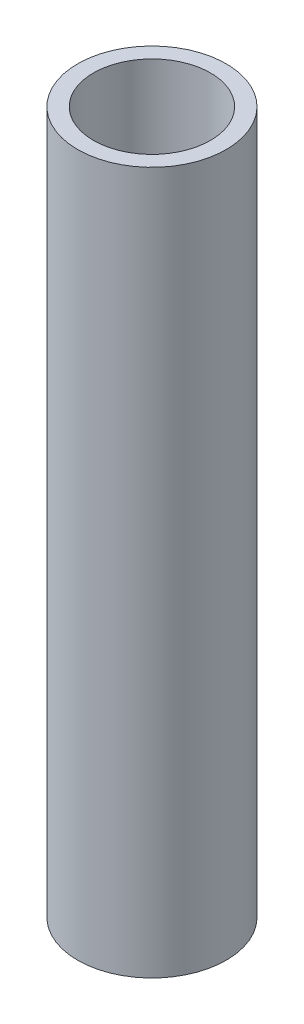
ISO-10303-21;
HEADER;
FILE_DESCRIPTION(('STEP AP214'),'2;1');
FILE_NAME('part.step','',(''),(''),'','','');
FILE_SCHEMA(('AUTOMOTIVE_DESIGN { 1 0 10303 214 1 1 1 1 }'));
ENDSEC;
DATA;
#1=APPLICATION_CONTEXT('core data for automotive mechanical design processes');
#2=APPLICATION_PROTOCOL_DEFINITION('international standard','automotive_design',2000,#1);
#3=PRODUCT_CONTEXT('',#1,'mechanical');
#4=PRODUCT('Part','Part','',(#3));
#5=PRODUCT_RELATED_PRODUCT_CATEGORY('part','',(#4));
#6=PRODUCT_DEFINITION_FORMATION('','',#4);
#7=PRODUCT_DEFINITION_CONTEXT('part definition',#1,'design');
#8=PRODUCT_DEFINITION('design','',#6,#7);
#9=PRODUCT_DEFINITION_SHAPE('','',#8);
#10=(LENGTH_UNIT() NAMED_UNIT(*) SI_UNIT(.MILLI.,.METRE.));
#11=(NAMED_UNIT(*) PLANE_ANGLE_UNIT() SI_UNIT($,.RADIAN.));
#12=(NAMED_UNIT(*) SI_UNIT($,.STERADIAN.) SOLID_ANGLE_UNIT());
#13=UNCERTAINTY_MEASURE_WITH_UNIT(LENGTH_MEASURE(1.E-05),#10,'distance_accuracy_value','');
#14=(GEOMETRIC_REPRESENTATION_CONTEXT(3) GLOBAL_UNCERTAINTY_ASSIGNED_CONTEXT((#13)) GLOBAL_UNIT_ASSIGNED_CONTEXT((#10,
#11,#12)) REPRESENTATION_CONTEXT('',''));
#15=CARTESIAN_POINT('',(0.,0.,0.));
#16=DIRECTION('',(0.,0.,1.));
#17=DIRECTION('',(1.,0.,0.));
#18=AXIS2_PLACEMENT_3D('',#15,#16,#17);
#19=CARTESIAN_POINT('',(0.,30.,0.));
#20=DIRECTION('',(0.,1.,0.));
#21=DIRECTION('',(0.,0.,1.));
#22=AXIS2_PLACEMENT_3D('',#19,#20,#21);
#23=PLANE('',#22);
#24=CARTESIAN_POINT('',(0.,30.,0.));
#25=DIRECTION('',(0.,1.,0.));
#26=DIRECTION('',(0.,0.,1.));
#27=AXIS2_PLACEMENT_3D('',#24,#25,#26);
#28=CIRCLE('',#27,3.175);
#29=CARTESIAN_POINT('',(0.,30.,3.175));
#30=VERTEX_POINT('',#29);
#31=EDGE_CURVE('E10',#30,#30,#28,.T.);
#32=ORIENTED_EDGE('',*,*,#31,.T.);
#33=EDGE_LOOP('',(#32));
#34=FACE_BOUND('',#33,.T.);
#35=CARTESIAN_POINT('',(0.,30.,0.));
#36=DIRECTION('',(0.,1.,0.));
#37=DIRECTION('',(0.,0.,1.));
#38=AXIS2_PLACEMENT_3D('',#35,#36,#37);
#39=CIRCLE('',#38,2.5);
#40=CARTESIAN_POINT('',(0.,30.,2.5));
#41=VERTEX_POINT('',#40);
#42=EDGE_CURVE('E50',#41,#41,#39,.T.);
#43=ORIENTED_EDGE('',*,*,#42,.F.);
#44=EDGE_LOOP('',(#43));
#45=FACE_BOUND('',#44,.T.);
#46=ADVANCED_FACE('F39',(#34,#45),#23,.T.);
#47=CARTESIAN_POINT('',(0.,0.,0.));
#48=DIRECTION('',(0.,1.,0.));
#49=DIRECTION('',(0.,0.,1.));
#50=AXIS2_PLACEMENT_3D('',#47,#48,#49);
#51=PLANE('',#50);
#52=CARTESIAN_POINT('',(0.,0.,0.));
#53=DIRECTION('',(0.,1.,0.));
#54=DIRECTION('',(0.,0.,1.));
#55=AXIS2_PLACEMENT_3D('',#52,#53,#54);
#56=CIRCLE('',#55,3.175);
#57=CARTESIAN_POINT('',(0.,0.,3.175));
#58=VERTEX_POINT('',#57);
#59=EDGE_CURVE('E43',#58,#58,#56,.T.);
#60=ORIENTED_EDGE('',*,*,#59,.F.);
#61=EDGE_LOOP('',(#60));
#62=FACE_BOUND('',#61,.T.);
#63=CARTESIAN_POINT('',(0.,0.,0.));
#64=DIRECTION('',(0.,1.,0.));
#65=DIRECTION('',(0.,0.,1.));
#66=AXIS2_PLACEMENT_3D('',#63,#64,#65);
#67=CIRCLE('',#66,2.5);
#68=CARTESIAN_POINT('',(0.,0.,2.5));
#69=VERTEX_POINT('',#68);
#70=EDGE_CURVE('E52',#69,#69,#67,.T.);
#71=ORIENTED_EDGE('',*,*,#70,.T.);
#72=EDGE_LOOP('',(#71));
#73=FACE_BOUND('',#72,.T.);
#74=ADVANCED_FACE('F62',(#62,#73),#51,.F.);
#75=CARTESIAN_POINT('',(0.,30.,0.));
#76=DIRECTION('',(0.,-1.,0.));
#77=DIRECTION('',(0.,0.,-1.));
#78=AXIS2_PLACEMENT_3D('',#75,#76,#77);
#79=CYLINDRICAL_SURFACE('',#78,3.175);
#80=ORIENTED_EDGE('',*,*,#31,.F.);
#81=EDGE_LOOP('',(#80));
#82=FACE_BOUND('',#81,.T.);
#83=ORIENTED_EDGE('',*,*,#59,.T.);
#84=EDGE_LOOP('',(#83));
#85=FACE_BOUND('',#84,.T.);
#86=ADVANCED_FACE('F41',(#82,#85),#79,.T.);
#87=CARTESIAN_POINT('',(0.,30.,0.));
#88=DIRECTION('',(0.,-1.,0.));
#89=DIRECTION('',(0.,0.,-1.));
#90=AXIS2_PLACEMENT_3D('',#87,#88,#89);
#91=CYLINDRICAL_SURFACE('',#90,2.5);
#92=ORIENTED_EDGE('',*,*,#42,.T.);
#93=EDGE_LOOP('',(#92));
#94=FACE_BOUND('',#93,.T.);
#95=ORIENTED_EDGE('',*,*,#70,.F.);
#96=EDGE_LOOP('',(#95));
#97=FACE_BOUND('',#96,.T.);
#98=ADVANCED_FACE('F58',(#94,#97),#91,.F.);
#99=CLOSED_SHELL('',(#46,#74,#86,#98));
#100=MANIFOLD_SOLID_BREP('B2',#99);
#101=ADVANCED_BREP_SHAPE_REPRESENTATION('',(#18,#100),#14);
#102=SHAPE_DEFINITION_REPRESENTATION(#9,#101);
ENDSEC;
END-ISO-10303-21;
